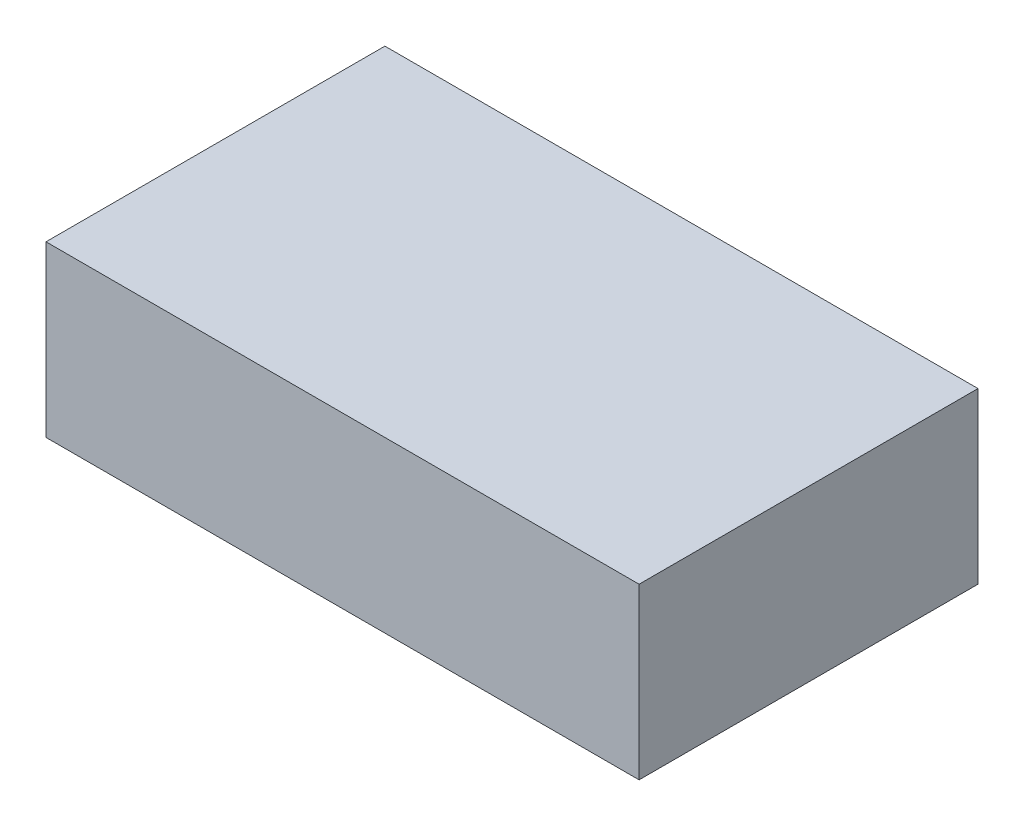
ISO-10303-21;
HEADER;
FILE_DESCRIPTION(('STEP AP214'),'2;1');
FILE_NAME('part.step','',(''),(''),'','','');
FILE_SCHEMA(('AUTOMOTIVE_DESIGN { 1 0 10303 214 1 1 1 1 }'));
ENDSEC;
DATA;
#1=APPLICATION_CONTEXT('core data for automotive mechanical design processes');
#2=APPLICATION_PROTOCOL_DEFINITION('international standard','automotive_design',2000,#1);
#3=PRODUCT_CONTEXT('',#1,'mechanical');
#4=PRODUCT('Part','Part','',(#3));
#5=PRODUCT_RELATED_PRODUCT_CATEGORY('part','',(#4));
#6=PRODUCT_DEFINITION_FORMATION('','',#4);
#7=PRODUCT_DEFINITION_CONTEXT('part definition',#1,'design');
#8=PRODUCT_DEFINITION('design','',#6,#7);
#9=PRODUCT_DEFINITION_SHAPE('','',#8);
#10=(LENGTH_UNIT() NAMED_UNIT(*) SI_UNIT(.MILLI.,.METRE.));
#11=(NAMED_UNIT(*) PLANE_ANGLE_UNIT() SI_UNIT($,.RADIAN.));
#12=(NAMED_UNIT(*) SI_UNIT($,.STERADIAN.) SOLID_ANGLE_UNIT());
#13=UNCERTAINTY_MEASURE_WITH_UNIT(LENGTH_MEASURE(1.E-05),#10,'distance_accuracy_value','');
#14=(GEOMETRIC_REPRESENTATION_CONTEXT(3) GLOBAL_UNCERTAINTY_ASSIGNED_CONTEXT((#13)) GLOBAL_UNIT_ASSIGNED_CONTEXT((#10,
#11,#12)) REPRESENTATION_CONTEXT('',''));
#15=CARTESIAN_POINT('',(0.,0.,0.));
#16=DIRECTION('',(0.,0.,1.));
#17=DIRECTION('',(1.,0.,0.));
#18=AXIS2_PLACEMENT_3D('',#15,#16,#17);
#19=CARTESIAN_POINT('',(350.,200.,-200.));
#20=DIRECTION('',(-1.,0.,0.));
#21=DIRECTION('',(0.,0.,1.));
#22=AXIS2_PLACEMENT_3D('',#19,#20,#21);
#23=PLANE('',#22);
#24=DIRECTION('',(0.,0.,-1.));
#25=VECTOR('',#24,1.);
#26=CARTESIAN_POINT('',(350.,0.,-200.));
#27=LINE('',#26,#25);
#28=CARTESIAN_POINT('',(350.,0.,200.));
#29=VERTEX_POINT('',#28);
#30=CARTESIAN_POINT('',(350.,0.,-200.));
#31=VERTEX_POINT('',#30);
#32=EDGE_CURVE('E100',#29,#31,#27,.T.);
#33=ORIENTED_EDGE('',*,*,#32,.T.);
#34=DIRECTION('',(0.,-1.,0.));
#35=VECTOR('',#34,1.);
#36=CARTESIAN_POINT('',(350.,200.,-200.));
#37=LINE('',#36,#35);
#38=CARTESIAN_POINT('',(350.,200.,-200.));
#39=VERTEX_POINT('',#38);
#40=EDGE_CURVE('E11',#39,#31,#37,.T.);
#41=ORIENTED_EDGE('',*,*,#40,.F.);
#42=DIRECTION('',(0.,0.,-1.));
#43=VECTOR('',#42,1.);
#44=CARTESIAN_POINT('',(350.,200.,-200.));
#45=LINE('',#44,#43);
#46=CARTESIAN_POINT('',(350.,200.,200.));
#47=VERTEX_POINT('',#46);
#48=EDGE_CURVE('E88',#47,#39,#45,.T.);
#49=ORIENTED_EDGE('',*,*,#48,.F.);
#50=DIRECTION('',(0.,-1.,0.));
#51=VECTOR('',#50,1.);
#52=CARTESIAN_POINT('',(350.,200.,200.));
#53=LINE('',#52,#51);
#54=EDGE_CURVE('E96',#47,#29,#53,.T.);
#55=ORIENTED_EDGE('',*,*,#54,.T.);
#56=EDGE_LOOP('',(#33,#41,#49,#55));
#57=FACE_BOUND('',#56,.T.);
#58=ADVANCED_FACE('F37',(#57),#23,.F.);
#59=CARTESIAN_POINT('',(-350.,200.,-200.));
#60=DIRECTION('',(0.,0.,1.));
#61=DIRECTION('',(1.,0.,0.));
#62=AXIS2_PLACEMENT_3D('',#59,#60,#61);
#63=PLANE('',#62);
#64=DIRECTION('',(-1.,0.,0.));
#65=VECTOR('',#64,1.);
#66=CARTESIAN_POINT('',(-350.,0.,-200.));
#67=LINE('',#66,#65);
#68=CARTESIAN_POINT('',(-350.,0.,-200.));
#69=VERTEX_POINT('',#68);
#70=EDGE_CURVE('E92',#31,#69,#67,.T.);
#71=ORIENTED_EDGE('',*,*,#70,.T.);
#72=DIRECTION('',(0.,-1.,0.));
#73=VECTOR('',#72,1.);
#74=CARTESIAN_POINT('',(-350.,200.,-200.));
#75=LINE('',#74,#73);
#76=CARTESIAN_POINT('',(-350.,200.,-200.));
#77=VERTEX_POINT('',#76);
#78=EDGE_CURVE('E45',#77,#69,#75,.T.);
#79=ORIENTED_EDGE('',*,*,#78,.F.);
#80=DIRECTION('',(-1.,0.,0.));
#81=VECTOR('',#80,1.);
#82=CARTESIAN_POINT('',(-350.,200.,-200.));
#83=LINE('',#82,#81);
#84=EDGE_CURVE('E83',#39,#77,#83,.T.);
#85=ORIENTED_EDGE('',*,*,#84,.F.);
#86=ORIENTED_EDGE('',*,*,#40,.T.);
#87=EDGE_LOOP('',(#71,#79,#85,#86));
#88=FACE_BOUND('',#87,.T.);
#89=ADVANCED_FACE('F91',(#88),#63,.F.);
#90=CARTESIAN_POINT('',(-350.,200.,-200.));
#91=DIRECTION('',(1.,0.,0.));
#92=DIRECTION('',(0.,0.,-1.));
#93=AXIS2_PLACEMENT_3D('',#90,#91,#92);
#94=PLANE('',#93);
#95=DIRECTION('',(0.,0.,1.));
#96=VECTOR('',#95,1.);
#97=CARTESIAN_POINT('',(-350.,0.,-200.));
#98=LINE('',#97,#96);
#99=CARTESIAN_POINT('',(-350.,0.,200.));
#100=VERTEX_POINT('',#99);
#101=EDGE_CURVE('E70',#69,#100,#98,.T.);
#102=ORIENTED_EDGE('',*,*,#101,.T.);
#103=DIRECTION('',(0.,-1.,0.));
#104=VECTOR('',#103,1.);
#105=CARTESIAN_POINT('',(-350.,200.,200.));
#106=LINE('',#105,#104);
#107=CARTESIAN_POINT('',(-350.,200.,200.));
#108=VERTEX_POINT('',#107);
#109=EDGE_CURVE('E93',#108,#100,#106,.T.);
#110=ORIENTED_EDGE('',*,*,#109,.F.);
#111=DIRECTION('',(0.,0.,1.));
#112=VECTOR('',#111,1.);
#113=CARTESIAN_POINT('',(-350.,200.,-200.));
#114=LINE('',#113,#112);
#115=EDGE_CURVE('E86',#77,#108,#114,.T.);
#116=ORIENTED_EDGE('',*,*,#115,.F.);
#117=ORIENTED_EDGE('',*,*,#78,.T.);
#118=EDGE_LOOP('',(#102,#110,#116,#117));
#119=FACE_BOUND('',#118,.T.);
#120=ADVANCED_FACE('F94',(#119),#94,.F.);
#121=CARTESIAN_POINT('',(-350.,200.,200.));
#122=DIRECTION('',(0.,0.,-1.));
#123=DIRECTION('',(-1.,0.,0.));
#124=AXIS2_PLACEMENT_3D('',#121,#122,#123);
#125=PLANE('',#124);
#126=DIRECTION('',(1.,0.,0.));
#127=VECTOR('',#126,1.);
#128=CARTESIAN_POINT('',(-350.,0.,200.));
#129=LINE('',#128,#127);
#130=EDGE_CURVE('E76',#100,#29,#129,.T.);
#131=ORIENTED_EDGE('',*,*,#130,.T.);
#132=ORIENTED_EDGE('',*,*,#54,.F.);
#133=DIRECTION('',(1.,0.,0.));
#134=VECTOR('',#133,1.);
#135=CARTESIAN_POINT('',(-350.,200.,200.));
#136=LINE('',#135,#134);
#137=EDGE_CURVE('E53',#108,#47,#136,.T.);
#138=ORIENTED_EDGE('',*,*,#137,.F.);
#139=ORIENTED_EDGE('',*,*,#109,.T.);
#140=EDGE_LOOP('',(#131,#132,#138,#139));
#141=FACE_BOUND('',#140,.T.);
#142=ADVANCED_FACE('F107',(#141),#125,.F.);
#143=CARTESIAN_POINT('',(0.,200.,0.));
#144=DIRECTION('',(0.,1.,0.));
#145=DIRECTION('',(0.,0.,1.));
#146=AXIS2_PLACEMENT_3D('',#143,#144,#145);
#147=PLANE('',#146);
#148=ORIENTED_EDGE('',*,*,#48,.T.);
#149=ORIENTED_EDGE('',*,*,#84,.T.);
#150=ORIENTED_EDGE('',*,*,#115,.T.);
#151=ORIENTED_EDGE('',*,*,#137,.T.);
#152=EDGE_LOOP('',(#148,#149,#150,#151));
#153=FACE_BOUND('',#152,.T.);
#154=ADVANCED_FACE('F84',(#153),#147,.T.);
#155=CARTESIAN_POINT('',(0.,0.,0.));
#156=DIRECTION('',(0.,1.,0.));
#157=DIRECTION('',(0.,0.,1.));
#158=AXIS2_PLACEMENT_3D('',#155,#156,#157);
#159=PLANE('',#158);
#160=ORIENTED_EDGE('',*,*,#32,.F.);
#161=ORIENTED_EDGE('',*,*,#130,.F.);
#162=ORIENTED_EDGE('',*,*,#101,.F.);
#163=ORIENTED_EDGE('',*,*,#70,.F.);
#164=EDGE_LOOP('',(#160,#161,#162,#163));
#165=FACE_BOUND('',#164,.T.);
#166=ADVANCED_FACE('F110',(#165),#159,.F.);
#167=CLOSED_SHELL('',(#58,#89,#120,#142,#154,#166));
#168=MANIFOLD_SOLID_BREP('B2',#167);
#169=ADVANCED_BREP_SHAPE_REPRESENTATION('',(#18,#168),#14);
#170=SHAPE_DEFINITION_REPRESENTATION(#9,#169);
ENDSEC;
END-ISO-10303-21;
